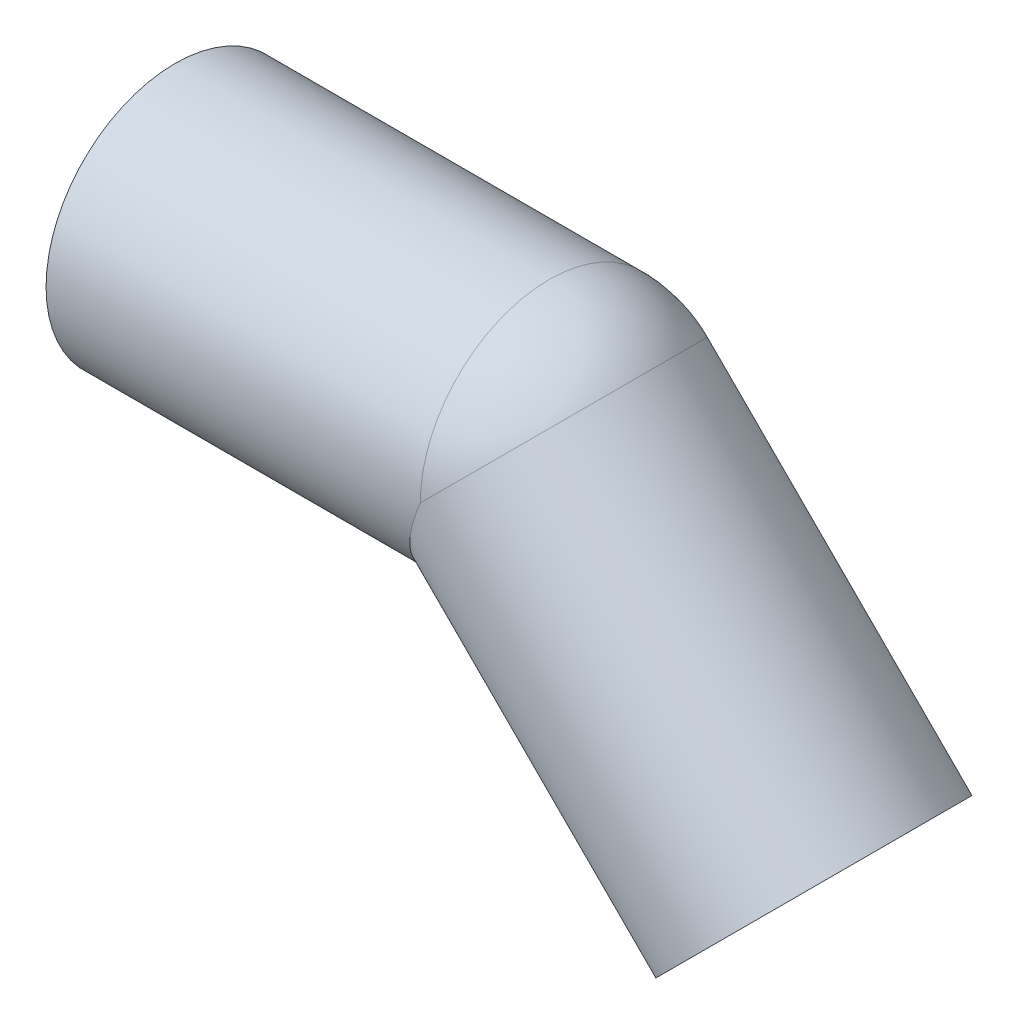
ISO-10303-21;
HEADER;
FILE_DESCRIPTION(('STEP AP214'),'2;1');
FILE_NAME('part.step','',(''),(''),'','','');
FILE_SCHEMA(('AUTOMOTIVE_DESIGN { 1 0 10303 214 1 1 1 1 }'));
ENDSEC;
DATA;
#1=APPLICATION_CONTEXT('core data for automotive mechanical design processes');
#2=APPLICATION_PROTOCOL_DEFINITION('international standard','automotive_design',2000,#1);
#3=PRODUCT_CONTEXT('',#1,'mechanical');
#4=PRODUCT('Part','Part','',(#3));
#5=PRODUCT_RELATED_PRODUCT_CATEGORY('part','',(#4));
#6=PRODUCT_DEFINITION_FORMATION('','',#4);
#7=PRODUCT_DEFINITION_CONTEXT('part definition',#1,'design');
#8=PRODUCT_DEFINITION('design','',#6,#7);
#9=PRODUCT_DEFINITION_SHAPE('','',#8);
#10=(LENGTH_UNIT() NAMED_UNIT(*) SI_UNIT(.MILLI.,.METRE.));
#11=(NAMED_UNIT(*) PLANE_ANGLE_UNIT() SI_UNIT($,.RADIAN.));
#12=(NAMED_UNIT(*) SI_UNIT($,.STERADIAN.) SOLID_ANGLE_UNIT());
#13=UNCERTAINTY_MEASURE_WITH_UNIT(LENGTH_MEASURE(1.E-05),#10,'distance_accuracy_value','');
#14=(GEOMETRIC_REPRESENTATION_CONTEXT(3) GLOBAL_UNCERTAINTY_ASSIGNED_CONTEXT((#13)) GLOBAL_UNIT_ASSIGNED_CONTEXT((#10,
#11,#12)) REPRESENTATION_CONTEXT('',''));
#15=CARTESIAN_POINT('',(0.,0.,0.));
#16=DIRECTION('',(0.,0.,1.));
#17=DIRECTION('',(1.,0.,0.));
#18=AXIS2_PLACEMENT_3D('',#15,#16,#17);
#19=CARTESIAN_POINT('',(99.0121933088197,-41.0121933088199,0.));
#20=DIRECTION('',(-0.707106781186544,0.707106781186551,0.));
#21=DIRECTION('',(-0.707106781186551,-0.707106781186544,0.));
#22=AXIS2_PLACEMENT_3D('',#19,#20,#21);
#23=CYLINDRICAL_SURFACE('',#22,17.6);
#24=CARTESIAN_POINT('',(58.,0.,0.));
#25=DIRECTION('',(0.707106781186548,-0.707106781186547,0.));
#26=DIRECTION('',(0.,0.,-1.));
#27=AXIS2_PLACEMENT_3D('',#24,#25,#26);
#28=CIRCLE('',#27,17.6);
#29=CARTESIAN_POINT('',(70.4450793488275,12.4450793489389,0.));
#30=VERTEX_POINT('',#29);
#31=CARTESIAN_POINT('',(58.0000000000001,0.,17.6));
#32=VERTEX_POINT('',#31);
#33=EDGE_CURVE('E53',#30,#32,#28,.T.);
#34=ORIENTED_EDGE('',*,*,#33,.F.);
#35=CARTESIAN_POINT('',(58.,0.,0.));
#36=DIRECTION('',(0.707106781196043,-0.707106781177052,0.));
#37=DIRECTION('',(0.,0.,-1.));
#38=AXIS2_PLACEMENT_3D('',#35,#36,#37);
#39=CIRCLE('',#38,17.6);
#40=CARTESIAN_POINT('',(58.0000000000001,0.,-17.6));
#41=VERTEX_POINT('',#40);
#42=EDGE_CURVE('E46',#41,#30,#39,.T.);
#43=ORIENTED_EDGE('',*,*,#42,.F.);
#44=CARTESIAN_POINT('',(58.0000000000002,0.,0.));
#45=DIRECTION('',(-0.923879532511286,0.382683432365092,0.));
#46=DIRECTION('',(-0.382683432365092,-0.923879532511286,0.));
#47=AXIS2_PLACEMENT_3D('',#44,#45,#46);
#48=ELLIPSE('',#47,19.0501027251462,17.6);
#49=EDGE_CURVE('E55',#32,#41,#48,.F.);
#50=ORIENTED_EDGE('',*,*,#49,.F.);
#51=EDGE_LOOP('',(#34,#43,#50));
#52=FACE_BOUND('',#51,.T.);
#53=CARTESIAN_POINT('',(99.0121933088196,-41.0121933088198,0.));
#54=DIRECTION('',(-0.707106781186544,0.707106781186551,0.));
#55=DIRECTION('',(-0.707106781186551,-0.707106781186544,0.));
#56=AXIS2_PLACEMENT_3D('',#53,#54,#55);
#57=CIRCLE('',#56,17.6);
#58=CARTESIAN_POINT('',(86.5671139599363,-53.457272657703,0.));
#59=VERTEX_POINT('',#58);
#60=EDGE_CURVE('E18',#59,#59,#57,.T.);
#61=ORIENTED_EDGE('',*,*,#60,.F.);
#62=EDGE_LOOP('',(#61));
#63=FACE_BOUND('',#62,.T.);
#64=ADVANCED_FACE('F15',(#52,#63),#23,.F.);
#65=CARTESIAN_POINT('',(58.,0.,0.));
#66=DIRECTION('',(0.,0.,1.));
#67=DIRECTION('',(-1.,0.,0.));
#68=AXIS2_PLACEMENT_3D('',#65,#66,#67);
#69=SPHERICAL_SURFACE('',#68,17.6);
#70=CARTESIAN_POINT('',(58.,0.,0.));
#71=DIRECTION('',(-1.,0.,0.));
#72=DIRECTION('',(0.,1.,0.));
#73=AXIS2_PLACEMENT_3D('',#70,#71,#72);
#74=CIRCLE('',#73,17.6);
#75=EDGE_CURVE('E51',#41,#32,#74,.F.);
#76=ORIENTED_EDGE('',*,*,#75,.F.);
#77=ORIENTED_EDGE('',*,*,#42,.T.);
#78=ORIENTED_EDGE('',*,*,#33,.T.);
#79=EDGE_LOOP('',(#76,#77,#78));
#80=FACE_BOUND('',#79,.T.);
#81=ADVANCED_FACE('F58',(#80),#69,.F.);
#82=CARTESIAN_POINT('',(113.154328932551,-26.8700576850887,20.2400021083328));
#83=DIRECTION('',(0.707106781186548,-0.707106781186547,0.));
#84=DIRECTION('',(-0.707106781186547,-0.707106781186548,0.));
#85=AXIS2_PLACEMENT_3D('',#82,#83,#84);
#86=PLANE('',#85);
#87=ORIENTED_EDGE('',*,*,#60,.T.);
#88=EDGE_LOOP('',(#87));
#89=FACE_BOUND('',#88,.T.);
#90=CARTESIAN_POINT('',(99.0121933088193,-41.0121933088199,0.));
#91=DIRECTION('',(-0.707106781186539,0.707106781186556,0.));
#92=DIRECTION('',(-0.707106781186556,-0.707106781186539,0.));
#93=AXIS2_PLACEMENT_3D('',#90,#91,#92);
#94=CIRCLE('',#93,20.);
#95=CARTESIAN_POINT('',(84.8700576850882,-55.1543289325506,0.));
#96=VERTEX_POINT('',#95);
#97=EDGE_CURVE('E71',#96,#96,#94,.T.);
#98=ORIENTED_EDGE('',*,*,#97,.F.);
#99=EDGE_LOOP('',(#98));
#100=FACE_BOUND('',#99,.T.);
#101=ADVANCED_FACE('F80',(#89,#100),#86,.T.);
#102=CARTESIAN_POINT('',(58.,0.,0.));
#103=DIRECTION('',(-1.,0.,0.));
#104=DIRECTION('',(0.,0.,1.));
#105=AXIS2_PLACEMENT_3D('',#102,#103,#104);
#106=CYLINDRICAL_SURFACE('',#105,17.6);
#107=CARTESIAN_POINT('',(0.,0.,0.));
#108=DIRECTION('',(-1.,0.,0.));
#109=DIRECTION('',(0.,0.,1.));
#110=AXIS2_PLACEMENT_3D('',#107,#108,#109);
#111=CIRCLE('',#110,17.6);
#112=CARTESIAN_POINT('',(0.,0.,17.6));
#113=VERTEX_POINT('',#112);
#114=EDGE_CURVE('E68',#113,#113,#111,.F.);
#115=ORIENTED_EDGE('',*,*,#114,.F.);
#116=EDGE_LOOP('',(#115));
#117=FACE_BOUND('',#116,.T.);
#118=ORIENTED_EDGE('',*,*,#49,.T.);
#119=ORIENTED_EDGE('',*,*,#75,.T.);
#120=EDGE_LOOP('',(#118,#119));
#121=FACE_BOUND('',#120,.T.);
#122=ADVANCED_FACE('F83',(#117,#121),#106,.F.);
#123=CARTESIAN_POINT('',(58.,0.,0.));
#124=DIRECTION('',(0.,0.,1.));
#125=DIRECTION('',(1.,0.,0.));
#126=AXIS2_PLACEMENT_3D('',#123,#124,#125);
#127=SPHERICAL_SURFACE('',#126,20.);
#128=CARTESIAN_POINT('',(58.,0.,0.));
#129=DIRECTION('',(-1.,0.,0.));
#130=DIRECTION('',(0.,1.,0.));
#131=AXIS2_PLACEMENT_3D('',#128,#129,#130);
#132=CIRCLE('',#131,20.);
#133=CARTESIAN_POINT('',(58.0000000000004,-1.58816699752743E-13,20.));
#134=VERTEX_POINT('',#133);
#135=CARTESIAN_POINT('',(58.0000000000004,-1.61977937144594E-13,-19.9999999999999));
#136=VERTEX_POINT('',#135);
#137=EDGE_CURVE('E67',#134,#136,#132,.T.);
#138=ORIENTED_EDGE('',*,*,#137,.F.);
#139=CARTESIAN_POINT('',(58.,0.,0.));
#140=DIRECTION('',(-0.707106781250441,0.707106781122654,0.));
#141=DIRECTION('',(0.,0.,1.));
#142=AXIS2_PLACEMENT_3D('',#139,#140,#141);
#143=CIRCLE('',#142,20.);
#144=CARTESIAN_POINT('',(72.1421356230921,14.1421356243698,0.));
#145=VERTEX_POINT('',#144);
#146=EDGE_CURVE('E73',#134,#145,#143,.T.);
#147=ORIENTED_EDGE('',*,*,#146,.T.);
#148=CARTESIAN_POINT('',(58.0000000000002,2.42861286636753E-13,0.));
#149=DIRECTION('',(-0.707106781186539,0.707106781186556,0.));
#150=DIRECTION('',(0.707106781186556,0.707106781186539,0.));
#151=AXIS2_PLACEMENT_3D('',#148,#149,#150);
#152=CIRCLE('',#151,19.9999999999997);
#153=EDGE_CURVE('E33',#136,#145,#152,.F.);
#154=ORIENTED_EDGE('',*,*,#153,.F.);
#155=EDGE_LOOP('',(#138,#147,#154));
#156=FACE_BOUND('',#155,.T.);
#157=ADVANCED_FACE('F87',(#156),#127,.T.);
#158=CARTESIAN_POINT('',(58.0000000000002,2.54136989230602E-13,0.));
#159=DIRECTION('',(-0.707106781186539,0.707106781186556,0.));
#160=DIRECTION('',(-0.707106781186556,-0.707106781186539,0.));
#161=AXIS2_PLACEMENT_3D('',#158,#159,#160);
#162=CYLINDRICAL_SURFACE('',#161,20.);
#163=ORIENTED_EDGE('',*,*,#97,.T.);
#164=EDGE_LOOP('',(#163));
#165=FACE_BOUND('',#164,.T.);
#166=CARTESIAN_POINT('',(58.0000000000005,0.,0.));
#167=DIRECTION('',(-0.923879532511284,0.382683432365095,0.));
#168=DIRECTION('',(-0.382683432365095,-0.923879532511285,0.));
#169=AXIS2_PLACEMENT_3D('',#166,#167,#168);
#170=ELLIPSE('',#169,21.6478440058479,20.);
#171=EDGE_CURVE('E24',#136,#134,#170,.T.);
#172=ORIENTED_EDGE('',*,*,#171,.F.);
#173=ORIENTED_EDGE('',*,*,#153,.T.);
#174=ORIENTED_EDGE('',*,*,#146,.F.);
#175=EDGE_LOOP('',(#172,#173,#174));
#176=FACE_BOUND('',#175,.T.);
#177=ADVANCED_FACE('F91',(#165,#176),#162,.T.);
#178=CARTESIAN_POINT('',(0.,-20.,20.2400021083327));
#179=DIRECTION('',(-1.,0.,0.));
#180=DIRECTION('',(0.,1.,0.));
#181=AXIS2_PLACEMENT_3D('',#178,#179,#180);
#182=PLANE('',#181);
#183=ORIENTED_EDGE('',*,*,#114,.T.);
#184=EDGE_LOOP('',(#183));
#185=FACE_BOUND('',#184,.T.);
#186=CARTESIAN_POINT('',(0.,0.,0.));
#187=DIRECTION('',(-1.,0.,0.));
#188=DIRECTION('',(0.,0.,1.));
#189=AXIS2_PLACEMENT_3D('',#186,#187,#188);
#190=CIRCLE('',#189,20.);
#191=CARTESIAN_POINT('',(0.,0.,20.));
#192=VERTEX_POINT('',#191);
#193=EDGE_CURVE('E9',#192,#192,#190,.F.);
#194=ORIENTED_EDGE('',*,*,#193,.F.);
#195=EDGE_LOOP('',(#194));
#196=FACE_BOUND('',#195,.T.);
#197=ADVANCED_FACE('F105',(#185,#196),#182,.T.);
#198=CARTESIAN_POINT('',(0.,0.,0.));
#199=DIRECTION('',(-1.,0.,0.));
#200=DIRECTION('',(0.,0.,1.));
#201=AXIS2_PLACEMENT_3D('',#198,#199,#200);
#202=CYLINDRICAL_SURFACE('',#201,20.);
#203=ORIENTED_EDGE('',*,*,#171,.T.);
#204=ORIENTED_EDGE('',*,*,#137,.T.);
#205=EDGE_LOOP('',(#203,#204));
#206=FACE_BOUND('',#205,.T.);
#207=ORIENTED_EDGE('',*,*,#193,.T.);
#208=EDGE_LOOP('',(#207));
#209=FACE_BOUND('',#208,.T.);
#210=ADVANCED_FACE('F102',(#206,#209),#202,.T.);
#211=CLOSED_SHELL('',(#64,#81,#101,#122,#157,#177,#197,#210));
#212=MANIFOLD_SOLID_BREP('B1',#211);
#213=ADVANCED_BREP_SHAPE_REPRESENTATION('',(#18,#212),#14);
#214=SHAPE_DEFINITION_REPRESENTATION(#9,#213);
ENDSEC;
END-ISO-10303-21;
